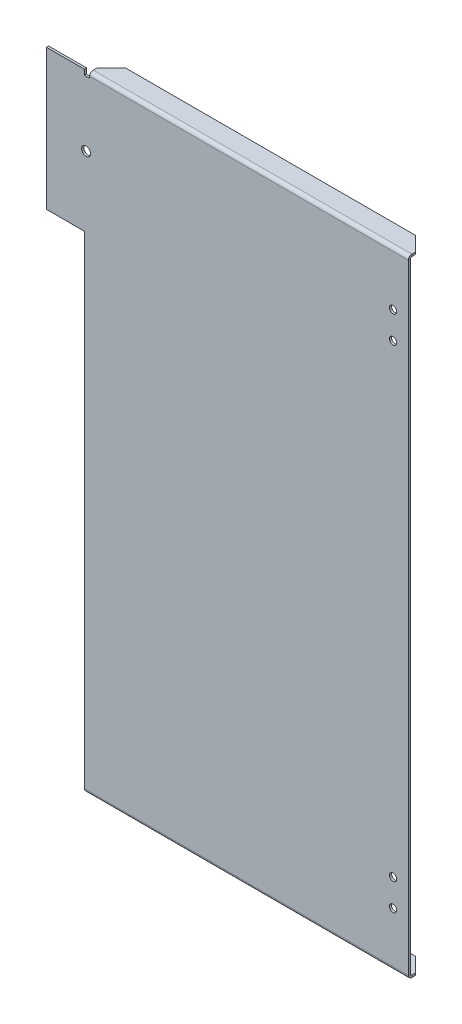
ISO-10303-21;
HEADER;
FILE_DESCRIPTION(('STEP AP214'),'2;1');
FILE_NAME('part.step','',(''),(''),'','','');
FILE_SCHEMA(('AUTOMOTIVE_DESIGN { 1 0 10303 214 1 1 1 1 }'));
ENDSEC;
DATA;
#1=APPLICATION_CONTEXT('core data for automotive mechanical design processes');
#2=APPLICATION_PROTOCOL_DEFINITION('international standard','automotive_design',2000,#1);
#3=PRODUCT_CONTEXT('',#1,'mechanical');
#4=PRODUCT('Part','Part','',(#3));
#5=PRODUCT_RELATED_PRODUCT_CATEGORY('part','',(#4));
#6=PRODUCT_DEFINITION_FORMATION('','',#4);
#7=PRODUCT_DEFINITION_CONTEXT('part definition',#1,'design');
#8=PRODUCT_DEFINITION('design','',#6,#7);
#9=PRODUCT_DEFINITION_SHAPE('','',#8);
#10=(LENGTH_UNIT() NAMED_UNIT(*) SI_UNIT(.MILLI.,.METRE.));
#11=(NAMED_UNIT(*) PLANE_ANGLE_UNIT() SI_UNIT($,.RADIAN.));
#12=(NAMED_UNIT(*) SI_UNIT($,.STERADIAN.) SOLID_ANGLE_UNIT());
#13=UNCERTAINTY_MEASURE_WITH_UNIT(LENGTH_MEASURE(1.E-05),#10,'distance_accuracy_value','');
#14=(GEOMETRIC_REPRESENTATION_CONTEXT(3) GLOBAL_UNCERTAINTY_ASSIGNED_CONTEXT((#13)) GLOBAL_UNIT_ASSIGNED_CONTEXT((#10,
#11,#12)) REPRESENTATION_CONTEXT('',''));
#15=CARTESIAN_POINT('',(0.,0.,0.));
#16=DIRECTION('',(0.,0.,1.));
#17=DIRECTION('',(1.,0.,0.));
#18=AXIS2_PLACEMENT_3D('',#15,#16,#17);
#19=CARTESIAN_POINT('',(0.,0.,-1.2));
#20=DIRECTION('',(0.,0.,1.));
#21=DIRECTION('',(1.,0.,0.));
#22=AXIS2_PLACEMENT_3D('',#19,#20,#21);
#23=PLANE('',#22);
#24=CARTESIAN_POINT('',(171.5,303.,-1.2));
#25=DIRECTION('',(0.,0.,1.));
#26=DIRECTION('',(1.,0.,0.));
#27=AXIS2_PLACEMENT_3D('',#24,#25,#26);
#28=CIRCLE('',#27,2.);
#29=CARTESIAN_POINT('',(173.5,303.,-1.2));
#30=VERTEX_POINT('',#29);
#31=EDGE_CURVE('E382',#30,#30,#28,.T.);
#32=ORIENTED_EDGE('',*,*,#31,.T.);
#33=EDGE_LOOP('',(#32));
#34=FACE_BOUND('',#33,.T.);
#35=CARTESIAN_POINT('',(171.5,45.,-1.2));
#36=DIRECTION('',(0.,0.,1.));
#37=DIRECTION('',(1.,0.,0.));
#38=AXIS2_PLACEMENT_3D('',#35,#36,#37);
#39=CIRCLE('',#38,2.);
#40=CARTESIAN_POINT('',(173.5,45.,-1.2));
#41=VERTEX_POINT('',#40);
#42=EDGE_CURVE('E379',#41,#41,#39,.T.);
#43=ORIENTED_EDGE('',*,*,#42,.T.);
#44=EDGE_LOOP('',(#43));
#45=FACE_BOUND('',#44,.T.);
#46=CARTESIAN_POINT('',(171.5,30.,-1.2));
#47=DIRECTION('',(0.,0.,1.));
#48=DIRECTION('',(1.,0.,0.));
#49=AXIS2_PLACEMENT_3D('',#46,#47,#48);
#50=CIRCLE('',#49,2.);
#51=CARTESIAN_POINT('',(173.5,30.,-1.2));
#52=VERTEX_POINT('',#51);
#53=EDGE_CURVE('E371',#52,#52,#50,.T.);
#54=ORIENTED_EDGE('',*,*,#53,.T.);
#55=EDGE_LOOP('',(#54));
#56=FACE_BOUND('',#55,.T.);
#57=CARTESIAN_POINT('',(171.5,318.,-1.2));
#58=DIRECTION('',(0.,0.,1.));
#59=DIRECTION('',(1.,0.,0.));
#60=AXIS2_PLACEMENT_3D('',#57,#58,#59);
#61=CIRCLE('',#60,2.);
#62=CARTESIAN_POINT('',(173.5,318.,-1.2));
#63=VERTEX_POINT('',#62);
#64=EDGE_CURVE('E388',#63,#63,#61,.T.);
#65=ORIENTED_EDGE('',*,*,#64,.T.);
#66=EDGE_LOOP('',(#65));
#67=FACE_BOUND('',#66,.T.);
#68=CARTESIAN_POINT('',(0.999999999999985,309.,-1.2));
#69=DIRECTION('',(0.,0.,1.));
#70=DIRECTION('',(1.,0.,0.));
#71=AXIS2_PLACEMENT_3D('',#68,#69,#70);
#72=CIRCLE('',#71,2.5);
#73=CARTESIAN_POINT('',(3.49999999999999,309.,-1.2));
#74=VERTEX_POINT('',#73);
#75=EDGE_CURVE('E394',#74,#74,#72,.T.);
#76=ORIENTED_EDGE('',*,*,#75,.T.);
#77=EDGE_LOOP('',(#76));
#78=FACE_BOUND('',#77,.T.);
#79=DIRECTION('',(-1.,0.,0.));
#80=VECTOR('',#79,1.);
#81=CARTESIAN_POINT('',(0.,1.9366,-1.19999999999999));
#82=LINE('',#81,#80);
#83=CARTESIAN_POINT('',(0.,1.9366,-1.19999999999999));
#84=VERTEX_POINT('',#83);
#85=CARTESIAN_POINT('',(180.,1.93660000000002,-1.19999999999999));
#86=VERTEX_POINT('',#85);
#87=EDGE_CURVE('E289',#84,#86,#82,.F.);
#88=ORIENTED_EDGE('',*,*,#87,.F.);
#89=DIRECTION('',(0.,-1.,0.));
#90=VECTOR('',#89,1.);
#91=CARTESIAN_POINT('',(0.,0.,-1.2));
#92=LINE('',#91,#90);
#93=CARTESIAN_POINT('',(0.,270.,-1.2));
#94=VERTEX_POINT('',#93);
#95=EDGE_CURVE('E398',#94,#84,#92,.T.);
#96=ORIENTED_EDGE('',*,*,#95,.F.);
#97=DIRECTION('',(1.,0.,0.));
#98=VECTOR('',#97,1.);
#99=CARTESIAN_POINT('',(0.,270.,-1.2));
#100=LINE('',#99,#98);
#101=CARTESIAN_POINT('',(-21.,270.,-1.2));
#102=VERTEX_POINT('',#101);
#103=EDGE_CURVE('E410',#102,#94,#100,.T.);
#104=ORIENTED_EDGE('',*,*,#103,.F.);
#105=DIRECTION('',(0.,-1.,0.));
#106=VECTOR('',#105,1.);
#107=CARTESIAN_POINT('',(-21.,270.,-1.2));
#108=LINE('',#107,#106);
#109=CARTESIAN_POINT('',(-21.,348.,-1.2));
#110=VERTEX_POINT('',#109);
#111=EDGE_CURVE('E407',#110,#102,#108,.T.);
#112=ORIENTED_EDGE('',*,*,#111,.F.);
#113=DIRECTION('',(-1.,0.,0.));
#114=VECTOR('',#113,1.);
#115=CARTESIAN_POINT('',(-21.,348.,-1.2));
#116=LINE('',#115,#114);
#117=CARTESIAN_POINT('',(0.,348.,-1.2));
#118=VERTEX_POINT('',#117);
#119=EDGE_CURVE('E405',#118,#110,#116,.T.);
#120=ORIENTED_EDGE('',*,*,#119,.F.);
#121=DIRECTION('',(0.,-1.,0.));
#122=VECTOR('',#121,1.);
#123=CARTESIAN_POINT('',(0.,0.,-1.2));
#124=LINE('',#123,#122);
#125=CARTESIAN_POINT('',(0.,345.,-1.2));
#126=VERTEX_POINT('',#125);
#127=EDGE_CURVE('E364',#118,#126,#124,.T.);
#128=ORIENTED_EDGE('',*,*,#127,.T.);
#129=DIRECTION('',(1.,0.,0.));
#130=VECTOR('',#129,1.);
#131=CARTESIAN_POINT('',(0.,345.,-1.2));
#132=LINE('',#131,#130);
#133=CARTESIAN_POINT('',(3.,345.,-1.2));
#134=VERTEX_POINT('',#133);
#135=EDGE_CURVE('E354',#126,#134,#132,.T.);
#136=ORIENTED_EDGE('',*,*,#135,.T.);
#137=DIRECTION('',(0.,1.,0.));
#138=VECTOR('',#137,1.);
#139=CARTESIAN_POINT('',(3.,0.,-1.2));
#140=LINE('',#139,#138);
#141=CARTESIAN_POINT('',(3.,346.0634,-1.19999999999998));
#142=VERTEX_POINT('',#141);
#143=EDGE_CURVE('E361',#134,#142,#140,.T.);
#144=ORIENTED_EDGE('',*,*,#143,.T.);
#145=DIRECTION('',(1.,0.,0.));
#146=VECTOR('',#145,1.);
#147=CARTESIAN_POINT('',(180.,346.0634,-1.19999999999998));
#148=LINE('',#147,#146);
#149=CARTESIAN_POINT('',(180.,346.0634,-1.19999999999998));
#150=VERTEX_POINT('',#149);
#151=EDGE_CURVE('E334',#150,#142,#148,.F.);
#152=ORIENTED_EDGE('',*,*,#151,.F.);
#153=DIRECTION('',(0.,1.,0.));
#154=VECTOR('',#153,1.);
#155=CARTESIAN_POINT('',(180.,0.,-1.2));
#156=LINE('',#155,#154);
#157=EDGE_CURVE('E401',#86,#150,#156,.T.);
#158=ORIENTED_EDGE('',*,*,#157,.F.);
#159=EDGE_LOOP('',(#88,#96,#104,#112,#120,#128,#136,#144,#152,#158));
#160=FACE_BOUND('',#159,.T.);
#161=ADVANCED_FACE('F79',(#34,#45,#56,#67,#78,#160),#23,.F.);
#162=CARTESIAN_POINT('',(0.,0.,0.));
#163=DIRECTION('',(0.,0.,1.));
#164=DIRECTION('',(1.,0.,0.));
#165=AXIS2_PLACEMENT_3D('',#162,#163,#164);
#166=PLANE('',#165);
#167=CARTESIAN_POINT('',(171.5,303.,0.));
#168=DIRECTION('',(0.,0.,1.));
#169=DIRECTION('',(1.,0.,0.));
#170=AXIS2_PLACEMENT_3D('',#167,#168,#169);
#171=CIRCLE('',#170,2.);
#172=CARTESIAN_POINT('',(173.5,303.,0.));
#173=VERTEX_POINT('',#172);
#174=EDGE_CURVE('E368',#173,#173,#171,.T.);
#175=ORIENTED_EDGE('',*,*,#174,.F.);
#176=EDGE_LOOP('',(#175));
#177=FACE_BOUND('',#176,.T.);
#178=CARTESIAN_POINT('',(171.5,45.,0.));
#179=DIRECTION('',(0.,0.,1.));
#180=DIRECTION('',(1.,0.,0.));
#181=AXIS2_PLACEMENT_3D('',#178,#179,#180);
#182=CIRCLE('',#181,2.);
#183=CARTESIAN_POINT('',(173.5,45.,0.));
#184=VERTEX_POINT('',#183);
#185=EDGE_CURVE('E372',#184,#184,#182,.T.);
#186=ORIENTED_EDGE('',*,*,#185,.F.);
#187=EDGE_LOOP('',(#186));
#188=FACE_BOUND('',#187,.T.);
#189=CARTESIAN_POINT('',(171.5,30.,0.));
#190=DIRECTION('',(0.,0.,1.));
#191=DIRECTION('',(1.,0.,0.));
#192=AXIS2_PLACEMENT_3D('',#189,#190,#191);
#193=CIRCLE('',#192,2.);
#194=CARTESIAN_POINT('',(173.5,30.,0.));
#195=VERTEX_POINT('',#194);
#196=EDGE_CURVE('E367',#195,#195,#193,.T.);
#197=ORIENTED_EDGE('',*,*,#196,.F.);
#198=EDGE_LOOP('',(#197));
#199=FACE_BOUND('',#198,.T.);
#200=CARTESIAN_POINT('',(171.5,318.,0.));
#201=DIRECTION('',(0.,0.,1.));
#202=DIRECTION('',(1.,0.,0.));
#203=AXIS2_PLACEMENT_3D('',#200,#201,#202);
#204=CIRCLE('',#203,2.);
#205=CARTESIAN_POINT('',(173.5,318.,0.));
#206=VERTEX_POINT('',#205);
#207=EDGE_CURVE('E385',#206,#206,#204,.T.);
#208=ORIENTED_EDGE('',*,*,#207,.F.);
#209=EDGE_LOOP('',(#208));
#210=FACE_BOUND('',#209,.T.);
#211=CARTESIAN_POINT('',(0.999999999999985,309.,0.));
#212=DIRECTION('',(0.,0.,1.));
#213=DIRECTION('',(1.,0.,0.));
#214=AXIS2_PLACEMENT_3D('',#211,#212,#213);
#215=CIRCLE('',#214,2.5);
#216=CARTESIAN_POINT('',(3.49999999999999,309.,0.));
#217=VERTEX_POINT('',#216);
#218=EDGE_CURVE('E391',#217,#217,#215,.T.);
#219=ORIENTED_EDGE('',*,*,#218,.F.);
#220=EDGE_LOOP('',(#219));
#221=FACE_BOUND('',#220,.T.);
#222=DIRECTION('',(0.,-1.,0.));
#223=VECTOR('',#222,1.);
#224=CARTESIAN_POINT('',(0.,0.,0.));
#225=LINE('',#224,#223);
#226=CARTESIAN_POINT('',(0.,270.,0.));
#227=VERTEX_POINT('',#226);
#228=CARTESIAN_POINT('',(0.,1.93660000000002,0.));
#229=VERTEX_POINT('',#228);
#230=EDGE_CURVE('E397',#227,#229,#225,.T.);
#231=ORIENTED_EDGE('',*,*,#230,.T.);
#232=DIRECTION('',(-1.,0.,0.));
#233=VECTOR('',#232,1.);
#234=CARTESIAN_POINT('',(0.,1.93660000000002,0.));
#235=LINE('',#234,#233);
#236=CARTESIAN_POINT('',(180.,1.93660000000002,0.));
#237=VERTEX_POINT('',#236);
#238=EDGE_CURVE('E238',#229,#237,#235,.F.);
#239=ORIENTED_EDGE('',*,*,#238,.T.);
#240=DIRECTION('',(0.,1.,0.));
#241=VECTOR('',#240,1.);
#242=CARTESIAN_POINT('',(180.,0.,0.));
#243=LINE('',#242,#241);
#244=CARTESIAN_POINT('',(180.,346.0634,0.));
#245=VERTEX_POINT('',#244);
#246=EDGE_CURVE('E416',#237,#245,#243,.T.);
#247=ORIENTED_EDGE('',*,*,#246,.T.);
#248=DIRECTION('',(1.,0.,0.));
#249=VECTOR('',#248,1.);
#250=CARTESIAN_POINT('',(180.,346.0634,0.));
#251=LINE('',#250,#249);
#252=CARTESIAN_POINT('',(3.,346.0634,0.));
#253=VERTEX_POINT('',#252);
#254=EDGE_CURVE('E321',#245,#253,#251,.F.);
#255=ORIENTED_EDGE('',*,*,#254,.T.);
#256=DIRECTION('',(0.,1.,0.));
#257=VECTOR('',#256,1.);
#258=CARTESIAN_POINT('',(3.,348.,0.));
#259=LINE('',#258,#257);
#260=CARTESIAN_POINT('',(3.,345.,0.));
#261=VERTEX_POINT('',#260);
#262=EDGE_CURVE('E348',#261,#253,#259,.T.);
#263=ORIENTED_EDGE('',*,*,#262,.F.);
#264=DIRECTION('',(1.,0.,0.));
#265=VECTOR('',#264,1.);
#266=CARTESIAN_POINT('',(0.,345.,0.));
#267=LINE('',#266,#265);
#268=CARTESIAN_POINT('',(0.,345.,0.));
#269=VERTEX_POINT('',#268);
#270=EDGE_CURVE('E345',#269,#261,#267,.T.);
#271=ORIENTED_EDGE('',*,*,#270,.F.);
#272=DIRECTION('',(0.,-1.,0.));
#273=VECTOR('',#272,1.);
#274=CARTESIAN_POINT('',(0.,348.,0.));
#275=LINE('',#274,#273);
#276=CARTESIAN_POINT('',(0.,348.,0.));
#277=VERTEX_POINT('',#276);
#278=EDGE_CURVE('E341',#277,#269,#275,.T.);
#279=ORIENTED_EDGE('',*,*,#278,.F.);
#280=DIRECTION('',(-1.,0.,0.));
#281=VECTOR('',#280,1.);
#282=CARTESIAN_POINT('',(-21.,348.,0.));
#283=LINE('',#282,#281);
#284=CARTESIAN_POINT('',(-21.,348.,0.));
#285=VERTEX_POINT('',#284);
#286=EDGE_CURVE('E419',#277,#285,#283,.T.);
#287=ORIENTED_EDGE('',*,*,#286,.T.);
#288=DIRECTION('',(0.,-1.,0.));
#289=VECTOR('',#288,1.);
#290=CARTESIAN_POINT('',(-21.,270.,0.));
#291=LINE('',#290,#289);
#292=CARTESIAN_POINT('',(-21.,270.,0.));
#293=VERTEX_POINT('',#292);
#294=EDGE_CURVE('E421',#285,#293,#291,.T.);
#295=ORIENTED_EDGE('',*,*,#294,.T.);
#296=DIRECTION('',(1.,0.,0.));
#297=VECTOR('',#296,1.);
#298=CARTESIAN_POINT('',(0.,270.,0.));
#299=LINE('',#298,#297);
#300=EDGE_CURVE('E402',#293,#227,#299,.T.);
#301=ORIENTED_EDGE('',*,*,#300,.T.);
#302=EDGE_LOOP('',(#231,#239,#247,#255,#263,#271,#279,#287,#295,#301));
#303=FACE_BOUND('',#302,.T.);
#304=ADVANCED_FACE('F511',(#177,#188,#199,#210,#221,#303),#166,.T.);
#305=CARTESIAN_POINT('',(0.,0.,-1.2));
#306=DIRECTION('',(-1.,0.,0.));
#307=DIRECTION('',(0.,0.,1.));
#308=AXIS2_PLACEMENT_3D('',#305,#306,#307);
#309=PLANE('',#308);
#310=ORIENTED_EDGE('',*,*,#95,.T.);
#311=DIRECTION('',(0.,0.,1.));
#312=VECTOR('',#311,1.);
#313=CARTESIAN_POINT('',(0.,1.9366,-1.19999999999999));
#314=LINE('',#313,#312);
#315=EDGE_CURVE('E285',#84,#229,#314,.T.);
#316=ORIENTED_EDGE('',*,*,#315,.T.);
#317=ORIENTED_EDGE('',*,*,#230,.F.);
#318=DIRECTION('',(0.,0.,1.));
#319=VECTOR('',#318,1.);
#320=CARTESIAN_POINT('',(0.,270.,-1.2));
#321=LINE('',#320,#319);
#322=EDGE_CURVE('E426',#94,#227,#321,.T.);
#323=ORIENTED_EDGE('',*,*,#322,.F.);
#324=EDGE_LOOP('',(#310,#316,#317,#323));
#325=FACE_BOUND('',#324,.T.);
#326=ADVANCED_FACE('F526',(#325),#309,.T.);
#327=CARTESIAN_POINT('',(180.,0.,-1.2));
#328=DIRECTION('',(1.,0.,0.));
#329=DIRECTION('',(0.,0.,-1.));
#330=AXIS2_PLACEMENT_3D('',#327,#328,#329);
#331=PLANE('',#330);
#332=DIRECTION('',(0.,0.,1.));
#333=VECTOR('',#332,1.);
#334=CARTESIAN_POINT('',(180.,1.93660000000002,-1.19999999999999));
#335=LINE('',#334,#333);
#336=EDGE_CURVE('E292',#86,#237,#335,.T.);
#337=ORIENTED_EDGE('',*,*,#336,.F.);
#338=ORIENTED_EDGE('',*,*,#157,.T.);
#339=DIRECTION('',(0.,0.,1.));
#340=VECTOR('',#339,1.);
#341=CARTESIAN_POINT('',(180.,346.0634,-1.19999999999998));
#342=LINE('',#341,#340);
#343=EDGE_CURVE('E328',#150,#245,#342,.T.);
#344=ORIENTED_EDGE('',*,*,#343,.T.);
#345=ORIENTED_EDGE('',*,*,#246,.F.);
#346=EDGE_LOOP('',(#337,#338,#344,#345));
#347=FACE_BOUND('',#346,.T.);
#348=ADVANCED_FACE('F530',(#347),#331,.T.);
#349=CARTESIAN_POINT('',(3.,348.,-10.));
#350=DIRECTION('',(1.,0.,0.));
#351=DIRECTION('',(0.,0.,-1.));
#352=AXIS2_PLACEMENT_3D('',#349,#350,#351);
#353=PLANE('',#352);
#354=DIRECTION('',(0.,0.,1.));
#355=VECTOR('',#354,1.);
#356=CARTESIAN_POINT('',(3.,346.0634,-1.19999999999998));
#357=LINE('',#356,#355);
#358=EDGE_CURVE('E338',#142,#253,#357,.T.);
#359=ORIENTED_EDGE('',*,*,#358,.F.);
#360=ORIENTED_EDGE('',*,*,#143,.F.);
#361=DIRECTION('',(0.,0.,1.));
#362=VECTOR('',#361,1.);
#363=CARTESIAN_POINT('',(3.,345.,-10.));
#364=LINE('',#363,#362);
#365=EDGE_CURVE('E355',#134,#261,#364,.T.);
#366=ORIENTED_EDGE('',*,*,#365,.T.);
#367=ORIENTED_EDGE('',*,*,#262,.T.);
#368=EDGE_LOOP('',(#359,#360,#366,#367));
#369=FACE_BOUND('',#368,.T.);
#370=ADVANCED_FACE('F494',(#369),#353,.F.);
#371=CARTESIAN_POINT('',(-21.,348.,-1.2));
#372=DIRECTION('',(0.,1.,0.));
#373=DIRECTION('',(0.,0.,1.));
#374=AXIS2_PLACEMENT_3D('',#371,#372,#373);
#375=PLANE('',#374);
#376=DIRECTION('',(0.,0.,1.));
#377=VECTOR('',#376,1.);
#378=CARTESIAN_POINT('',(0.,348.,-10.));
#379=LINE('',#378,#377);
#380=EDGE_CURVE('E352',#118,#277,#379,.T.);
#381=ORIENTED_EDGE('',*,*,#380,.F.);
#382=ORIENTED_EDGE('',*,*,#119,.T.);
#383=DIRECTION('',(0.,0.,1.));
#384=VECTOR('',#383,1.);
#385=CARTESIAN_POINT('',(-21.,348.,-1.2));
#386=LINE('',#385,#384);
#387=EDGE_CURVE('E413',#110,#285,#386,.T.);
#388=ORIENTED_EDGE('',*,*,#387,.T.);
#389=ORIENTED_EDGE('',*,*,#286,.F.);
#390=EDGE_LOOP('',(#381,#382,#388,#389));
#391=FACE_BOUND('',#390,.T.);
#392=ADVANCED_FACE('F513',(#391),#375,.T.);
#393=CARTESIAN_POINT('',(0.,270.,-1.2));
#394=DIRECTION('',(0.,-1.,0.));
#395=DIRECTION('',(0.,0.,-1.));
#396=AXIS2_PLACEMENT_3D('',#393,#394,#395);
#397=PLANE('',#396);
#398=ORIENTED_EDGE('',*,*,#300,.F.);
#399=DIRECTION('',(0.,0.,1.));
#400=VECTOR('',#399,1.);
#401=CARTESIAN_POINT('',(-21.,270.,-1.2));
#402=LINE('',#401,#400);
#403=EDGE_CURVE('E429',#102,#293,#402,.T.);
#404=ORIENTED_EDGE('',*,*,#403,.F.);
#405=ORIENTED_EDGE('',*,*,#103,.T.);
#406=ORIENTED_EDGE('',*,*,#322,.T.);
#407=EDGE_LOOP('',(#398,#404,#405,#406));
#408=FACE_BOUND('',#407,.T.);
#409=ADVANCED_FACE('F521',(#408),#397,.T.);
#410=CARTESIAN_POINT('',(-21.,270.,-1.2));
#411=DIRECTION('',(-1.,0.,0.));
#412=DIRECTION('',(0.,0.,1.));
#413=AXIS2_PLACEMENT_3D('',#410,#411,#412);
#414=PLANE('',#413);
#415=ORIENTED_EDGE('',*,*,#294,.F.);
#416=ORIENTED_EDGE('',*,*,#387,.F.);
#417=ORIENTED_EDGE('',*,*,#111,.T.);
#418=ORIENTED_EDGE('',*,*,#403,.T.);
#419=EDGE_LOOP('',(#415,#416,#417,#418));
#420=FACE_BOUND('',#419,.T.);
#421=ADVANCED_FACE('F518',(#420),#414,.T.);
#422=CARTESIAN_POINT('',(0.999999999999985,309.,-10.));
#423=DIRECTION('',(0.,0.,1.));
#424=DIRECTION('',(1.,0.,0.));
#425=AXIS2_PLACEMENT_3D('',#422,#423,#424);
#426=CYLINDRICAL_SURFACE('',#425,2.5);
#427=ORIENTED_EDGE('',*,*,#218,.T.);
#428=EDGE_LOOP('',(#427));
#429=FACE_BOUND('',#428,.T.);
#430=ORIENTED_EDGE('',*,*,#75,.F.);
#431=EDGE_LOOP('',(#430));
#432=FACE_BOUND('',#431,.T.);
#433=ADVANCED_FACE('F572',(#429,#432),#426,.F.);
#434=CARTESIAN_POINT('',(171.5,318.,-10.));
#435=DIRECTION('',(0.,0.,1.));
#436=DIRECTION('',(1.,0.,0.));
#437=AXIS2_PLACEMENT_3D('',#434,#435,#436);
#438=CYLINDRICAL_SURFACE('',#437,2.);
#439=ORIENTED_EDGE('',*,*,#207,.T.);
#440=EDGE_LOOP('',(#439));
#441=FACE_BOUND('',#440,.T.);
#442=ORIENTED_EDGE('',*,*,#64,.F.);
#443=EDGE_LOOP('',(#442));
#444=FACE_BOUND('',#443,.T.);
#445=ADVANCED_FACE('F619',(#441,#444),#438,.F.);
#446=CARTESIAN_POINT('',(171.5,30.,-10.));
#447=DIRECTION('',(0.,0.,1.));
#448=DIRECTION('',(1.,0.,0.));
#449=AXIS2_PLACEMENT_3D('',#446,#447,#448);
#450=CYLINDRICAL_SURFACE('',#449,2.);
#451=ORIENTED_EDGE('',*,*,#196,.T.);
#452=EDGE_LOOP('',(#451));
#453=FACE_BOUND('',#452,.T.);
#454=ORIENTED_EDGE('',*,*,#53,.F.);
#455=EDGE_LOOP('',(#454));
#456=FACE_BOUND('',#455,.T.);
#457=ADVANCED_FACE('F626',(#453,#456),#450,.F.);
#458=CARTESIAN_POINT('',(171.5,45.,-10.));
#459=DIRECTION('',(0.,0.,1.));
#460=DIRECTION('',(1.,0.,0.));
#461=AXIS2_PLACEMENT_3D('',#458,#459,#460);
#462=CYLINDRICAL_SURFACE('',#461,2.);
#463=ORIENTED_EDGE('',*,*,#185,.T.);
#464=EDGE_LOOP('',(#463));
#465=FACE_BOUND('',#464,.T.);
#466=ORIENTED_EDGE('',*,*,#42,.F.);
#467=EDGE_LOOP('',(#466));
#468=FACE_BOUND('',#467,.T.);
#469=ADVANCED_FACE('F633',(#465,#468),#462,.F.);
#470=CARTESIAN_POINT('',(171.5,303.,-10.));
#471=DIRECTION('',(0.,0.,1.));
#472=DIRECTION('',(1.,0.,0.));
#473=AXIS2_PLACEMENT_3D('',#470,#471,#472);
#474=CYLINDRICAL_SURFACE('',#473,2.);
#475=ORIENTED_EDGE('',*,*,#174,.T.);
#476=EDGE_LOOP('',(#475));
#477=FACE_BOUND('',#476,.T.);
#478=ORIENTED_EDGE('',*,*,#31,.F.);
#479=EDGE_LOOP('',(#478));
#480=FACE_BOUND('',#479,.T.);
#481=ADVANCED_FACE('F641',(#477,#480),#474,.F.);
#482=CARTESIAN_POINT('',(0.,348.,-10.));
#483=DIRECTION('',(-1.,0.,0.));
#484=DIRECTION('',(0.,-1.,0.));
#485=AXIS2_PLACEMENT_3D('',#482,#483,#484);
#486=PLANE('',#485);
#487=ORIENTED_EDGE('',*,*,#380,.T.);
#488=ORIENTED_EDGE('',*,*,#278,.T.);
#489=DIRECTION('',(0.,0.,1.));
#490=VECTOR('',#489,1.);
#491=CARTESIAN_POINT('',(0.,345.,-10.));
#492=LINE('',#491,#490);
#493=EDGE_CURVE('E351',#126,#269,#492,.T.);
#494=ORIENTED_EDGE('',*,*,#493,.F.);
#495=ORIENTED_EDGE('',*,*,#127,.F.);
#496=EDGE_LOOP('',(#487,#488,#494,#495));
#497=FACE_BOUND('',#496,.T.);
#498=ADVANCED_FACE('F506',(#497),#486,.F.);
#499=CARTESIAN_POINT('',(0.,345.,-10.));
#500=DIRECTION('',(0.,-1.,0.));
#501=DIRECTION('',(0.,0.,-1.));
#502=AXIS2_PLACEMENT_3D('',#499,#500,#501);
#503=PLANE('',#502);
#504=ORIENTED_EDGE('',*,*,#493,.T.);
#505=ORIENTED_EDGE('',*,*,#270,.T.);
#506=ORIENTED_EDGE('',*,*,#365,.F.);
#507=ORIENTED_EDGE('',*,*,#135,.F.);
#508=EDGE_LOOP('',(#504,#505,#506,#507));
#509=FACE_BOUND('',#508,.T.);
#510=ADVANCED_FACE('F503',(#509),#503,.F.);
#511=CARTESIAN_POINT('',(3.,346.0634,-1.93659999999996));
#512=DIRECTION('',(-1.,0.,0.));
#513=DIRECTION('',(0.,0.,1.));
#514=AXIS2_PLACEMENT_3D('',#511,#512,#513);
#515=PLANE('',#514);
#516=DIRECTION('',(0.,-1.,0.));
#517=VECTOR('',#516,1.);
#518=CARTESIAN_POINT('',(3.,348.,-1.93659999999995));
#519=LINE('',#518,#517);
#520=CARTESIAN_POINT('',(3.,346.8,-1.93659999999996));
#521=VERTEX_POINT('',#520);
#522=CARTESIAN_POINT('',(3.,348.,-1.93659999999995));
#523=VERTEX_POINT('',#522);
#524=EDGE_CURVE('E295',#521,#523,#519,.F.);
#525=ORIENTED_EDGE('',*,*,#524,.F.);
#526=CARTESIAN_POINT('',(3.,346.0634,-1.93659999999996));
#527=DIRECTION('',(1.,0.,0.));
#528=DIRECTION('',(0.,0.,-1.));
#529=AXIS2_PLACEMENT_3D('',#526,#527,#528);
#530=CIRCLE('',#529,0.736599999999976);
#531=EDGE_CURVE('E331',#142,#521,#530,.F.);
#532=ORIENTED_EDGE('',*,*,#531,.F.);
#533=ORIENTED_EDGE('',*,*,#358,.T.);
#534=CARTESIAN_POINT('',(3.,346.0634,-1.93659999999996));
#535=DIRECTION('',(1.,0.,0.));
#536=DIRECTION('',(0.,0.,-1.));
#537=AXIS2_PLACEMENT_3D('',#534,#535,#536);
#538=CIRCLE('',#537,1.93659999999998);
#539=EDGE_CURVE('E324',#253,#523,#538,.F.);
#540=ORIENTED_EDGE('',*,*,#539,.T.);
#541=EDGE_LOOP('',(#525,#532,#533,#540));
#542=FACE_BOUND('',#541,.T.);
#543=ADVANCED_FACE('F483',(#542),#515,.T.);
#544=CARTESIAN_POINT('',(180.,346.0634,-1.93659999999996));
#545=DIRECTION('',(-1.,0.,0.));
#546=DIRECTION('',(0.,0.,1.));
#547=AXIS2_PLACEMENT_3D('',#544,#545,#546);
#548=PLANE('',#547);
#549=CARTESIAN_POINT('',(180.,346.0634,-1.93659999999996));
#550=DIRECTION('',(1.,0.,0.));
#551=DIRECTION('',(0.,0.,-1.));
#552=AXIS2_PLACEMENT_3D('',#549,#550,#551);
#553=CIRCLE('',#552,0.736599999999976);
#554=CARTESIAN_POINT('',(180.,346.8,-1.93659999999996));
#555=VERTEX_POINT('',#554);
#556=EDGE_CURVE('E299',#555,#150,#553,.T.);
#557=ORIENTED_EDGE('',*,*,#556,.F.);
#558=DIRECTION('',(0.,-1.,0.));
#559=VECTOR('',#558,1.);
#560=CARTESIAN_POINT('',(180.,346.8,-1.93659999999996));
#561=LINE('',#560,#559);
#562=CARTESIAN_POINT('',(180.,348.,-1.93659999999995));
#563=VERTEX_POINT('',#562);
#564=EDGE_CURVE('E314',#555,#563,#561,.F.);
#565=ORIENTED_EDGE('',*,*,#564,.T.);
#566=CARTESIAN_POINT('',(180.,346.0634,-1.93659999999996));
#567=DIRECTION('',(1.,0.,0.));
#568=DIRECTION('',(0.,0.,-1.));
#569=AXIS2_PLACEMENT_3D('',#566,#567,#568);
#570=CIRCLE('',#569,1.93659999999998);
#571=EDGE_CURVE('E325',#563,#245,#570,.T.);
#572=ORIENTED_EDGE('',*,*,#571,.T.);
#573=ORIENTED_EDGE('',*,*,#343,.F.);
#574=EDGE_LOOP('',(#557,#565,#572,#573));
#575=FACE_BOUND('',#574,.T.);
#576=ADVANCED_FACE('F478',(#575),#548,.F.);
#577=CARTESIAN_POINT('',(180.,346.0634,-1.93659999999996));
#578=DIRECTION('',(1.,0.,0.));
#579=DIRECTION('',(0.,1.,0.));
#580=AXIS2_PLACEMENT_3D('',#577,#578,#579);
#581=CYLINDRICAL_SURFACE('',#580,1.93659999999998);
#582=ORIENTED_EDGE('',*,*,#254,.F.);
#583=ORIENTED_EDGE('',*,*,#571,.F.);
#584=DIRECTION('',(1.,0.,0.));
#585=VECTOR('',#584,1.);
#586=CARTESIAN_POINT('',(3.,348.,-1.93659999999995));
#587=LINE('',#586,#585);
#588=EDGE_CURVE('E311',#563,#523,#587,.F.);
#589=ORIENTED_EDGE('',*,*,#588,.T.);
#590=ORIENTED_EDGE('',*,*,#539,.F.);
#591=EDGE_LOOP('',(#582,#583,#589,#590));
#592=FACE_BOUND('',#591,.T.);
#593=ADVANCED_FACE('F480',(#592),#581,.T.);
#594=CARTESIAN_POINT('',(180.,346.0634,-1.93659999999996));
#595=DIRECTION('',(1.,0.,0.));
#596=DIRECTION('',(0.,1.,0.));
#597=AXIS2_PLACEMENT_3D('',#594,#595,#596);
#598=CYLINDRICAL_SURFACE('',#597,0.736599999999976);
#599=ORIENTED_EDGE('',*,*,#151,.T.);
#600=ORIENTED_EDGE('',*,*,#531,.T.);
#601=DIRECTION('',(1.,0.,0.));
#602=VECTOR('',#601,1.);
#603=CARTESIAN_POINT('',(3.,346.8,-1.93659999999996));
#604=LINE('',#603,#602);
#605=EDGE_CURVE('E317',#521,#555,#604,.T.);
#606=ORIENTED_EDGE('',*,*,#605,.T.);
#607=ORIENTED_EDGE('',*,*,#556,.T.);
#608=EDGE_LOOP('',(#599,#600,#606,#607));
#609=FACE_BOUND('',#608,.T.);
#610=ADVANCED_FACE('F491',(#609),#598,.F.);
#611=CARTESIAN_POINT('',(180.,348.,-12.));
#612=DIRECTION('',(-1.,0.,0.));
#613=DIRECTION('',(0.,-1.,0.));
#614=AXIS2_PLACEMENT_3D('',#611,#612,#613);
#615=PLANE('',#614);
#616=DIRECTION('',(0.,0.,1.));
#617=VECTOR('',#616,1.);
#618=CARTESIAN_POINT('',(180.,346.8,-12.));
#619=LINE('',#618,#617);
#620=CARTESIAN_POINT('',(180.,346.8,-3.99999999999994));
#621=VERTEX_POINT('',#620);
#622=EDGE_CURVE('E309',#555,#621,#619,.F.);
#623=ORIENTED_EDGE('',*,*,#622,.T.);
#624=DIRECTION('',(0.,1.,0.));
#625=VECTOR('',#624,1.);
#626=CARTESIAN_POINT('',(180.,348.,-3.99999999999994));
#627=LINE('',#626,#625);
#628=CARTESIAN_POINT('',(180.,348.,-3.99999999999994));
#629=VERTEX_POINT('',#628);
#630=EDGE_CURVE('E102',#621,#629,#627,.T.);
#631=ORIENTED_EDGE('',*,*,#630,.T.);
#632=DIRECTION('',(0.,0.,-1.));
#633=VECTOR('',#632,1.);
#634=CARTESIAN_POINT('',(180.,348.,1.79288242839159E-12));
#635=LINE('',#634,#633);
#636=EDGE_CURVE('E302',#563,#629,#635,.T.);
#637=ORIENTED_EDGE('',*,*,#636,.F.);
#638=ORIENTED_EDGE('',*,*,#564,.F.);
#639=EDGE_LOOP('',(#623,#631,#637,#638));
#640=FACE_BOUND('',#639,.T.);
#641=ADVANCED_FACE('F475',(#640),#615,.F.);
#642=CARTESIAN_POINT('',(3.,348.,-1.2));
#643=DIRECTION('',(1.,0.,0.));
#644=DIRECTION('',(0.,1.,0.));
#645=AXIS2_PLACEMENT_3D('',#642,#643,#644);
#646=PLANE('',#645);
#647=DIRECTION('',(0.,0.,1.));
#648=VECTOR('',#647,1.);
#649=CARTESIAN_POINT('',(3.,348.,1.79288242839159E-12));
#650=LINE('',#649,#648);
#651=CARTESIAN_POINT('',(3.,348.,-3.99999999999999));
#652=VERTEX_POINT('',#651);
#653=EDGE_CURVE('E297',#652,#523,#650,.T.);
#654=ORIENTED_EDGE('',*,*,#653,.F.);
#655=DIRECTION('',(0.,-1.,0.));
#656=VECTOR('',#655,1.);
#657=CARTESIAN_POINT('',(3.,348.,-3.99999999999999));
#658=LINE('',#657,#656);
#659=CARTESIAN_POINT('',(3.,346.8,-4.));
#660=VERTEX_POINT('',#659);
#661=EDGE_CURVE('E13',#652,#660,#658,.T.);
#662=ORIENTED_EDGE('',*,*,#661,.T.);
#663=DIRECTION('',(0.,0.,-1.));
#664=VECTOR('',#663,1.);
#665=CARTESIAN_POINT('',(3.,346.8,-1.2));
#666=LINE('',#665,#664);
#667=EDGE_CURVE('E304',#660,#521,#666,.F.);
#668=ORIENTED_EDGE('',*,*,#667,.T.);
#669=ORIENTED_EDGE('',*,*,#524,.T.);
#670=EDGE_LOOP('',(#654,#662,#668,#669));
#671=FACE_BOUND('',#670,.T.);
#672=ADVANCED_FACE('F487',(#671),#646,.F.);
#673=CARTESIAN_POINT('',(0.,348.,1.79288242839159E-12));
#674=DIRECTION('',(0.,-1.,0.));
#675=DIRECTION('',(0.,0.,-1.));
#676=AXIS2_PLACEMENT_3D('',#673,#674,#675);
#677=PLANE('',#676);
#678=ORIENTED_EDGE('',*,*,#636,.T.);
#679=DIRECTION('',(0.707106781186543,0.,0.707106781186552));
#680=VECTOR('',#679,1.);
#681=CARTESIAN_POINT('',(172.,348.,-12.));
#682=LINE('',#681,#680);
#683=CARTESIAN_POINT('',(172.,348.,-12.));
#684=VERTEX_POINT('',#683);
#685=EDGE_CURVE('E87',#629,#684,#682,.F.);
#686=ORIENTED_EDGE('',*,*,#685,.T.);
#687=DIRECTION('',(-1.,0.,0.));
#688=VECTOR('',#687,1.);
#689=CARTESIAN_POINT('',(0.,348.,-12.));
#690=LINE('',#689,#688);
#691=CARTESIAN_POINT('',(11.0000000000001,348.,-12.));
#692=VERTEX_POINT('',#691);
#693=EDGE_CURVE('E300',#684,#692,#690,.T.);
#694=ORIENTED_EDGE('',*,*,#693,.T.);
#695=DIRECTION('',(0.70710678118655,0.,-0.707106781186545));
#696=VECTOR('',#695,1.);
#697=CARTESIAN_POINT('',(3.,348.,-3.99999999999999));
#698=LINE('',#697,#696);
#699=EDGE_CURVE('E94',#692,#652,#698,.F.);
#700=ORIENTED_EDGE('',*,*,#699,.T.);
#701=ORIENTED_EDGE('',*,*,#653,.T.);
#702=ORIENTED_EDGE('',*,*,#588,.F.);
#703=EDGE_LOOP('',(#678,#686,#694,#700,#701,#702));
#704=FACE_BOUND('',#703,.T.);
#705=ADVANCED_FACE('F461',(#704),#677,.F.);
#706=CARTESIAN_POINT('',(0.,346.8,1.78869265078497E-12));
#707=DIRECTION('',(0.,-1.,0.));
#708=DIRECTION('',(0.,0.,-1.));
#709=AXIS2_PLACEMENT_3D('',#706,#707,#708);
#710=PLANE('',#709);
#711=DIRECTION('',(1.,0.,0.));
#712=VECTOR('',#711,1.);
#713=CARTESIAN_POINT('',(3.,346.8,-12.));
#714=LINE('',#713,#712);
#715=CARTESIAN_POINT('',(172.,346.8,-12.));
#716=VERTEX_POINT('',#715);
#717=CARTESIAN_POINT('',(11.0000000000001,346.8,-12.));
#718=VERTEX_POINT('',#717);
#719=EDGE_CURVE('E306',#716,#718,#714,.F.);
#720=ORIENTED_EDGE('',*,*,#719,.F.);
#721=DIRECTION('',(-0.707106781186543,0.,-0.707106781186552));
#722=VECTOR('',#721,1.);
#723=CARTESIAN_POINT('',(92.0000000000021,346.800000000001,-91.999999999999));
#724=LINE('',#723,#722);
#725=EDGE_CURVE('E456',#716,#621,#724,.F.);
#726=ORIENTED_EDGE('',*,*,#725,.T.);
#727=ORIENTED_EDGE('',*,*,#622,.F.);
#728=ORIENTED_EDGE('',*,*,#605,.F.);
#729=ORIENTED_EDGE('',*,*,#667,.F.);
#730=DIRECTION('',(-0.70710678118655,0.,0.707106781186545));
#731=VECTOR('',#730,1.);
#732=CARTESIAN_POINT('',(-0.500000000000903,346.8,-0.499999999999118));
#733=LINE('',#732,#731);
#734=EDGE_CURVE('E454',#660,#718,#733,.F.);
#735=ORIENTED_EDGE('',*,*,#734,.T.);
#736=EDGE_LOOP('',(#720,#726,#727,#728,#729,#735));
#737=FACE_BOUND('',#736,.T.);
#738=ADVANCED_FACE('F472',(#737),#710,.T.);
#739=CARTESIAN_POINT('',(3.,348.,-12.));
#740=DIRECTION('',(0.,0.,1.));
#741=DIRECTION('',(0.,-1.,0.));
#742=AXIS2_PLACEMENT_3D('',#739,#740,#741);
#743=PLANE('',#742);
#744=ORIENTED_EDGE('',*,*,#693,.F.);
#745=DIRECTION('',(0.,-1.,0.));
#746=VECTOR('',#745,1.);
#747=CARTESIAN_POINT('',(172.,348.,-12.));
#748=LINE('',#747,#746);
#749=EDGE_CURVE('E451',#684,#716,#748,.T.);
#750=ORIENTED_EDGE('',*,*,#749,.T.);
#751=ORIENTED_EDGE('',*,*,#719,.T.);
#752=DIRECTION('',(0.,1.,0.));
#753=VECTOR('',#752,1.);
#754=CARTESIAN_POINT('',(11.0000000000001,348.,-12.));
#755=LINE('',#754,#753);
#756=EDGE_CURVE('E449',#718,#692,#755,.T.);
#757=ORIENTED_EDGE('',*,*,#756,.T.);
#758=EDGE_LOOP('',(#744,#750,#751,#757));
#759=FACE_BOUND('',#758,.T.);
#760=ADVANCED_FACE('F466',(#759),#743,.F.);
#761=CARTESIAN_POINT('',(180.,1.93660000000001,-1.9366));
#762=DIRECTION('',(1.,0.,0.));
#763=DIRECTION('',(0.,1.,0.));
#764=AXIS2_PLACEMENT_3D('',#761,#762,#763);
#765=PLANE('',#764);
#766=DIRECTION('',(0.,1.,0.));
#767=VECTOR('',#766,1.);
#768=CARTESIAN_POINT('',(180.,0.,-1.93659999999999));
#769=LINE('',#768,#767);
#770=CARTESIAN_POINT('',(180.,1.2,-1.9366));
#771=VERTEX_POINT('',#770);
#772=CARTESIAN_POINT('',(180.,0.,-1.93659999999999));
#773=VERTEX_POINT('',#772);
#774=EDGE_CURVE('E280',#771,#773,#769,.F.);
#775=ORIENTED_EDGE('',*,*,#774,.F.);
#776=CARTESIAN_POINT('',(180.,1.93660000000001,-1.9366));
#777=DIRECTION('',(-1.,0.,0.));
#778=DIRECTION('',(0.,-1.,0.));
#779=AXIS2_PLACEMENT_3D('',#776,#777,#778);
#780=CIRCLE('',#779,0.736600000000013);
#781=EDGE_CURVE('E241',#86,#771,#780,.F.);
#782=ORIENTED_EDGE('',*,*,#781,.F.);
#783=ORIENTED_EDGE('',*,*,#336,.T.);
#784=CARTESIAN_POINT('',(180.,1.93660000000001,-1.9366));
#785=DIRECTION('',(-1.,0.,0.));
#786=DIRECTION('',(0.,-1.,0.));
#787=AXIS2_PLACEMENT_3D('',#784,#785,#786);
#788=CIRCLE('',#787,1.93660000000001);
#789=EDGE_CURVE('E284',#237,#773,#788,.F.);
#790=ORIENTED_EDGE('',*,*,#789,.T.);
#791=EDGE_LOOP('',(#775,#782,#783,#790));
#792=FACE_BOUND('',#791,.T.);
#793=ADVANCED_FACE('F537',(#792),#765,.T.);
#794=CARTESIAN_POINT('',(0.,1.93659999999998,-1.9366));
#795=DIRECTION('',(1.,0.,0.));
#796=DIRECTION('',(0.,1.,0.));
#797=AXIS2_PLACEMENT_3D('',#794,#795,#796);
#798=PLANE('',#797);
#799=CARTESIAN_POINT('',(0.,1.93659999999998,-1.9366));
#800=DIRECTION('',(-1.,0.,0.));
#801=DIRECTION('',(0.,-1.,0.));
#802=AXIS2_PLACEMENT_3D('',#799,#800,#801);
#803=CIRCLE('',#802,0.736600000000013);
#804=CARTESIAN_POINT('',(0.,1.19999999999997,-1.9366));
#805=VERTEX_POINT('',#804);
#806=EDGE_CURVE('E248',#805,#84,#803,.T.);
#807=ORIENTED_EDGE('',*,*,#806,.F.);
#808=DIRECTION('',(0.,1.,0.));
#809=VECTOR('',#808,1.);
#810=CARTESIAN_POINT('',(0.,1.2,-1.9366));
#811=LINE('',#810,#809);
#812=CARTESIAN_POINT('',(0.,0.,-1.93659999999999));
#813=VERTEX_POINT('',#812);
#814=EDGE_CURVE('E245',#805,#813,#811,.F.);
#815=ORIENTED_EDGE('',*,*,#814,.T.);
#816=CARTESIAN_POINT('',(0.,1.93659999999998,-1.9366));
#817=DIRECTION('',(-1.,0.,0.));
#818=DIRECTION('',(0.,-1.,0.));
#819=AXIS2_PLACEMENT_3D('',#816,#817,#818);
#820=CIRCLE('',#819,1.93660000000001);
#821=EDGE_CURVE('E231',#813,#229,#820,.T.);
#822=ORIENTED_EDGE('',*,*,#821,.T.);
#823=ORIENTED_EDGE('',*,*,#315,.F.);
#824=EDGE_LOOP('',(#807,#815,#822,#823));
#825=FACE_BOUND('',#824,.T.);
#826=ADVANCED_FACE('F246',(#825),#798,.F.);
#827=CARTESIAN_POINT('',(0.,1.93659999999998,-1.9366));
#828=DIRECTION('',(-1.,0.,0.));
#829=DIRECTION('',(0.,-1.,0.));
#830=AXIS2_PLACEMENT_3D('',#827,#828,#829);
#831=CYLINDRICAL_SURFACE('',#830,1.93660000000001);
#832=ORIENTED_EDGE('',*,*,#238,.F.);
#833=ORIENTED_EDGE('',*,*,#821,.F.);
#834=DIRECTION('',(-1.,0.,0.));
#835=VECTOR('',#834,1.);
#836=CARTESIAN_POINT('',(180.,0.,-1.93659999999999));
#837=LINE('',#836,#835);
#838=EDGE_CURVE('E235',#813,#773,#837,.F.);
#839=ORIENTED_EDGE('',*,*,#838,.T.);
#840=ORIENTED_EDGE('',*,*,#789,.F.);
#841=EDGE_LOOP('',(#832,#833,#839,#840));
#842=FACE_BOUND('',#841,.T.);
#843=ADVANCED_FACE('F233',(#842),#831,.T.);
#844=CARTESIAN_POINT('',(0.,1.93659999999998,-1.9366));
#845=DIRECTION('',(-1.,0.,0.));
#846=DIRECTION('',(0.,-1.,0.));
#847=AXIS2_PLACEMENT_3D('',#844,#845,#846);
#848=CYLINDRICAL_SURFACE('',#847,0.736600000000013);
#849=ORIENTED_EDGE('',*,*,#87,.T.);
#850=ORIENTED_EDGE('',*,*,#781,.T.);
#851=DIRECTION('',(-1.,0.,0.));
#852=VECTOR('',#851,1.);
#853=CARTESIAN_POINT('',(180.,1.2,-1.9366));
#854=LINE('',#853,#852);
#855=EDGE_CURVE('E253',#771,#805,#854,.T.);
#856=ORIENTED_EDGE('',*,*,#855,.T.);
#857=ORIENTED_EDGE('',*,*,#806,.T.);
#858=EDGE_LOOP('',(#849,#850,#856,#857));
#859=FACE_BOUND('',#858,.T.);
#860=ADVANCED_FACE('F533',(#859),#848,.F.);
#861=CARTESIAN_POINT('',(0.,0.,-12.));
#862=DIRECTION('',(1.,0.,0.));
#863=DIRECTION('',(0.,0.,-1.));
#864=AXIS2_PLACEMENT_3D('',#861,#862,#863);
#865=PLANE('',#864);
#866=DIRECTION('',(0.,0.,1.));
#867=VECTOR('',#866,1.);
#868=CARTESIAN_POINT('',(0.,1.19999999999996,-12.));
#869=LINE('',#868,#867);
#870=CARTESIAN_POINT('',(0.,1.19999999999999,-3.99999999999994));
#871=VERTEX_POINT('',#870);
#872=EDGE_CURVE('E262',#805,#871,#869,.F.);
#873=ORIENTED_EDGE('',*,*,#872,.T.);
#874=DIRECTION('',(0.,-1.,0.));
#875=VECTOR('',#874,1.);
#876=CARTESIAN_POINT('',(0.,0.,-3.99999999999994));
#877=LINE('',#876,#875);
#878=CARTESIAN_POINT('',(0.,0.,-3.99999999999994));
#879=VERTEX_POINT('',#878);
#880=EDGE_CURVE('E266',#871,#879,#877,.T.);
#881=ORIENTED_EDGE('',*,*,#880,.T.);
#882=DIRECTION('',(0.,0.,-1.));
#883=VECTOR('',#882,1.);
#884=CARTESIAN_POINT('',(0.,0.,0.));
#885=LINE('',#884,#883);
#886=EDGE_CURVE('E258',#813,#879,#885,.T.);
#887=ORIENTED_EDGE('',*,*,#886,.F.);
#888=ORIENTED_EDGE('',*,*,#814,.F.);
#889=EDGE_LOOP('',(#873,#881,#887,#888));
#890=FACE_BOUND('',#889,.T.);
#891=ADVANCED_FACE('F264',(#890),#865,.F.);
#892=CARTESIAN_POINT('',(180.,0.,-1.2));
#893=DIRECTION('',(-1.,0.,0.));
#894=DIRECTION('',(0.,0.,1.));
#895=AXIS2_PLACEMENT_3D('',#892,#893,#894);
#896=PLANE('',#895);
#897=DIRECTION('',(0.,0.,1.));
#898=VECTOR('',#897,1.);
#899=CARTESIAN_POINT('',(180.,0.,0.));
#900=LINE('',#899,#898);
#901=CARTESIAN_POINT('',(180.,0.,-3.99999999999999));
#902=VERTEX_POINT('',#901);
#903=EDGE_CURVE('E261',#902,#773,#900,.T.);
#904=ORIENTED_EDGE('',*,*,#903,.F.);
#905=DIRECTION('',(0.,1.,0.));
#906=VECTOR('',#905,1.);
#907=CARTESIAN_POINT('',(180.,0.,-3.99999999999999));
#908=LINE('',#907,#906);
#909=CARTESIAN_POINT('',(180.,1.19999999999999,-4.));
#910=VERTEX_POINT('',#909);
#911=EDGE_CURVE('E446',#902,#910,#908,.T.);
#912=ORIENTED_EDGE('',*,*,#911,.T.);
#913=DIRECTION('',(0.,0.,-1.));
#914=VECTOR('',#913,1.);
#915=CARTESIAN_POINT('',(180.,1.2,-1.2));
#916=LINE('',#915,#914);
#917=EDGE_CURVE('E268',#910,#771,#916,.F.);
#918=ORIENTED_EDGE('',*,*,#917,.T.);
#919=ORIENTED_EDGE('',*,*,#774,.T.);
#920=EDGE_LOOP('',(#904,#912,#918,#919));
#921=FACE_BOUND('',#920,.T.);
#922=ADVANCED_FACE('F539',(#921),#896,.F.);
#923=CARTESIAN_POINT('',(0.,0.,0.));
#924=DIRECTION('',(0.,1.,0.));
#925=DIRECTION('',(0.,0.,1.));
#926=AXIS2_PLACEMENT_3D('',#923,#924,#925);
#927=PLANE('',#926);
#928=ORIENTED_EDGE('',*,*,#886,.T.);
#929=DIRECTION('',(-0.707106781186545,0.,0.70710678118655));
#930=VECTOR('',#929,1.);
#931=CARTESIAN_POINT('',(8.00000000000001,0.,-12.));
#932=LINE('',#931,#930);
#933=CARTESIAN_POINT('',(8.00000000000001,0.,-12.));
#934=VERTEX_POINT('',#933);
#935=EDGE_CURVE('E444',#879,#934,#932,.F.);
#936=ORIENTED_EDGE('',*,*,#935,.T.);
#937=DIRECTION('',(1.,0.,0.));
#938=VECTOR('',#937,1.);
#939=CARTESIAN_POINT('',(0.,0.,-12.));
#940=LINE('',#939,#938);
#941=CARTESIAN_POINT('',(172.,0.,-12.));
#942=VERTEX_POINT('',#941);
#943=EDGE_CURVE('E267',#934,#942,#940,.T.);
#944=ORIENTED_EDGE('',*,*,#943,.T.);
#945=DIRECTION('',(-0.70710678118655,0.,-0.707106781186545));
#946=VECTOR('',#945,1.);
#947=CARTESIAN_POINT('',(180.,0.,-3.99999999999999));
#948=LINE('',#947,#946);
#949=EDGE_CURVE('E442',#942,#902,#948,.F.);
#950=ORIENTED_EDGE('',*,*,#949,.T.);
#951=ORIENTED_EDGE('',*,*,#903,.T.);
#952=ORIENTED_EDGE('',*,*,#838,.F.);
#953=EDGE_LOOP('',(#928,#936,#944,#950,#951,#952));
#954=FACE_BOUND('',#953,.T.);
#955=ADVANCED_FACE('F257',(#954),#927,.F.);
#956=CARTESIAN_POINT('',(0.,1.2,0.));
#957=DIRECTION('',(0.,1.,0.));
#958=DIRECTION('',(0.,0.,1.));
#959=AXIS2_PLACEMENT_3D('',#956,#957,#958);
#960=PLANE('',#959);
#961=DIRECTION('',(-1.,0.,0.));
#962=VECTOR('',#961,1.);
#963=CARTESIAN_POINT('',(180.,1.19999999999996,-12.));
#964=LINE('',#963,#962);
#965=CARTESIAN_POINT('',(8.00000000000001,1.19999999999996,-12.));
#966=VERTEX_POINT('',#965);
#967=CARTESIAN_POINT('',(172.,1.19999999999996,-12.));
#968=VERTEX_POINT('',#967);
#969=EDGE_CURVE('E272',#966,#968,#964,.F.);
#970=ORIENTED_EDGE('',*,*,#969,.F.);
#971=DIRECTION('',(0.707106781186545,0.,-0.70710678118655));
#972=VECTOR('',#971,1.);
#973=CARTESIAN_POINT('',(-1.99999999999997,1.2,-1.99999999999996));
#974=LINE('',#973,#972);
#975=EDGE_CURVE('E439',#966,#871,#974,.F.);
#976=ORIENTED_EDGE('',*,*,#975,.T.);
#977=ORIENTED_EDGE('',*,*,#872,.F.);
#978=ORIENTED_EDGE('',*,*,#855,.F.);
#979=ORIENTED_EDGE('',*,*,#917,.F.);
#980=DIRECTION('',(0.70710678118655,0.,0.707106781186545));
#981=VECTOR('',#980,1.);
#982=CARTESIAN_POINT('',(91.9999999999993,1.19999999999968,-92.));
#983=LINE('',#982,#981);
#984=EDGE_CURVE('E437',#910,#968,#983,.F.);
#985=ORIENTED_EDGE('',*,*,#984,.T.);
#986=EDGE_LOOP('',(#970,#976,#977,#978,#979,#985));
#987=FACE_BOUND('',#986,.T.);
#988=ADVANCED_FACE('F544',(#987),#960,.T.);
#989=CARTESIAN_POINT('',(180.,0.,-12.));
#990=DIRECTION('',(0.,0.,1.));
#991=DIRECTION('',(0.,-1.,0.));
#992=AXIS2_PLACEMENT_3D('',#989,#990,#991);
#993=PLANE('',#992);
#994=ORIENTED_EDGE('',*,*,#943,.F.);
#995=DIRECTION('',(0.,1.,0.));
#996=VECTOR('',#995,1.);
#997=CARTESIAN_POINT('',(8.00000000000001,0.,-12.));
#998=LINE('',#997,#996);
#999=EDGE_CURVE('E434',#934,#966,#998,.T.);
#1000=ORIENTED_EDGE('',*,*,#999,.T.);
#1001=ORIENTED_EDGE('',*,*,#969,.T.);
#1002=DIRECTION('',(0.,-1.,0.));
#1003=VECTOR('',#1002,1.);
#1004=CARTESIAN_POINT('',(172.,0.,-12.));
#1005=LINE('',#1004,#1003);
#1006=EDGE_CURVE('E428',#968,#942,#1005,.T.);
#1007=ORIENTED_EDGE('',*,*,#1006,.T.);
#1008=EDGE_LOOP('',(#994,#1000,#1001,#1007));
#1009=FACE_BOUND('',#1008,.T.);
#1010=ADVANCED_FACE('F551',(#1009),#993,.F.);
#1011=CARTESIAN_POINT('',(8.00000000000001,0.,-12.));
#1012=DIRECTION('',(0.70710678118655,0.,0.707106781186545));
#1013=DIRECTION('',(0.,1.,0.));
#1014=AXIS2_PLACEMENT_3D('',#1011,#1012,#1013);
#1015=PLANE('',#1014);
#1016=ORIENTED_EDGE('',*,*,#935,.F.);
#1017=ORIENTED_EDGE('',*,*,#880,.F.);
#1018=ORIENTED_EDGE('',*,*,#975,.F.);
#1019=ORIENTED_EDGE('',*,*,#999,.F.);
#1020=EDGE_LOOP('',(#1016,#1017,#1018,#1019));
#1021=FACE_BOUND('',#1020,.T.);
#1022=ADVANCED_FACE('F546',(#1021),#1015,.F.);
#1023=CARTESIAN_POINT('',(180.,0.,-3.99999999999999));
#1024=DIRECTION('',(-0.707106781186545,0.,0.70710678118655));
#1025=DIRECTION('',(0.,1.,0.));
#1026=AXIS2_PLACEMENT_3D('',#1023,#1024,#1025);
#1027=PLANE('',#1026);
#1028=ORIENTED_EDGE('',*,*,#949,.F.);
#1029=ORIENTED_EDGE('',*,*,#1006,.F.);
#1030=ORIENTED_EDGE('',*,*,#984,.F.);
#1031=ORIENTED_EDGE('',*,*,#911,.F.);
#1032=EDGE_LOOP('',(#1028,#1029,#1030,#1031));
#1033=FACE_BOUND('',#1032,.T.);
#1034=ADVANCED_FACE('F554',(#1033),#1027,.F.);
#1035=CARTESIAN_POINT('',(172.,348.,-12.));
#1036=DIRECTION('',(-0.707106781186552,0.,0.707106781186543));
#1037=DIRECTION('',(0.,-1.,0.));
#1038=AXIS2_PLACEMENT_3D('',#1035,#1036,#1037);
#1039=PLANE('',#1038);
#1040=ORIENTED_EDGE('',*,*,#685,.F.);
#1041=ORIENTED_EDGE('',*,*,#630,.F.);
#1042=ORIENTED_EDGE('',*,*,#725,.F.);
#1043=ORIENTED_EDGE('',*,*,#749,.F.);
#1044=EDGE_LOOP('',(#1040,#1041,#1042,#1043));
#1045=FACE_BOUND('',#1044,.T.);
#1046=ADVANCED_FACE('F469',(#1045),#1039,.F.);
#1047=CARTESIAN_POINT('',(3.,348.,-3.99999999999999));
#1048=DIRECTION('',(0.707106781186545,0.,0.70710678118655));
#1049=DIRECTION('',(0.,-1.,0.));
#1050=AXIS2_PLACEMENT_3D('',#1047,#1048,#1049);
#1051=PLANE('',#1050);
#1052=ORIENTED_EDGE('',*,*,#699,.F.);
#1053=ORIENTED_EDGE('',*,*,#756,.F.);
#1054=ORIENTED_EDGE('',*,*,#734,.F.);
#1055=ORIENTED_EDGE('',*,*,#661,.F.);
#1056=EDGE_LOOP('',(#1052,#1053,#1054,#1055));
#1057=FACE_BOUND('',#1056,.T.);
#1058=ADVANCED_FACE('F81',(#1057),#1051,.F.);
#1059=CLOSED_SHELL('',(#161,#304,#326,#348,#370,#392,#409,#421,#433,#445,#457,#469,#481,#498,
#510,#543,#576,#593,#610,#641,#672,#705,#738,#760,#793,#826,#843,#860,#891,#922,#955,#988,#1010,
#1022,#1034,#1046,#1058));
#1060=MANIFOLD_SOLID_BREP('B2',#1059);
#1061=ADVANCED_BREP_SHAPE_REPRESENTATION('',(#18,#1060),#14);
#1062=SHAPE_DEFINITION_REPRESENTATION(#9,#1061);
ENDSEC;
END-ISO-10303-21;
